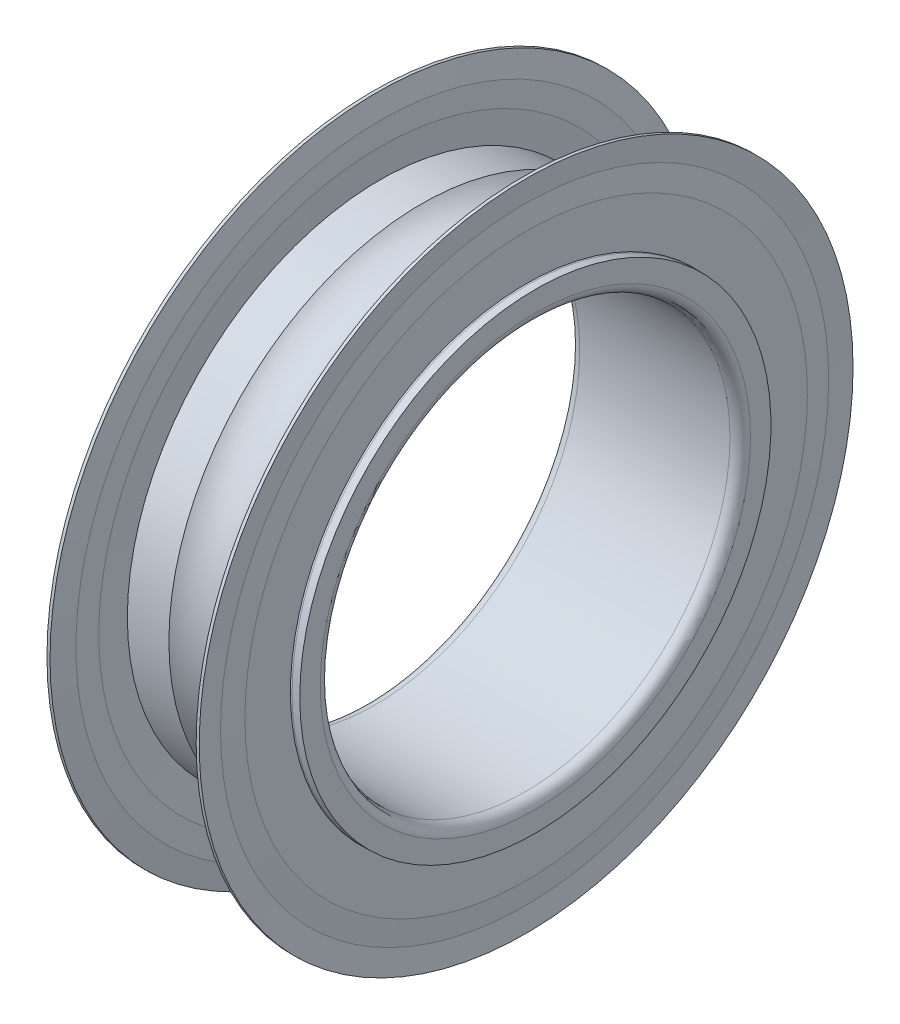
ISO-10303-21;
HEADER;
FILE_DESCRIPTION(('STEP AP214'),'2;1');
FILE_NAME('part.step','',(''),(''),'','','');
FILE_SCHEMA(('AUTOMOTIVE_DESIGN { 1 0 10303 214 1 1 1 1 }'));
ENDSEC;
DATA;
#1=APPLICATION_CONTEXT('core data for automotive mechanical design processes');
#2=APPLICATION_PROTOCOL_DEFINITION('international standard','automotive_design',2000,#1);
#3=PRODUCT_CONTEXT('',#1,'mechanical');
#4=PRODUCT('Part','Part','',(#3));
#5=PRODUCT_RELATED_PRODUCT_CATEGORY('part','',(#4));
#6=PRODUCT_DEFINITION_FORMATION('','',#4);
#7=PRODUCT_DEFINITION_CONTEXT('part definition',#1,'design');
#8=PRODUCT_DEFINITION('design','',#6,#7);
#9=PRODUCT_DEFINITION_SHAPE('','',#8);
#10=(LENGTH_UNIT() NAMED_UNIT(*) SI_UNIT(.MILLI.,.METRE.));
#11=(NAMED_UNIT(*) PLANE_ANGLE_UNIT() SI_UNIT($,.RADIAN.));
#12=(NAMED_UNIT(*) SI_UNIT($,.STERADIAN.) SOLID_ANGLE_UNIT());
#13=UNCERTAINTY_MEASURE_WITH_UNIT(LENGTH_MEASURE(1.E-05),#10,'distance_accuracy_value','');
#14=(GEOMETRIC_REPRESENTATION_CONTEXT(3) GLOBAL_UNCERTAINTY_ASSIGNED_CONTEXT((#13)) GLOBAL_UNIT_ASSIGNED_CONTEXT((#10,
#11,#12)) REPRESENTATION_CONTEXT('',''));
#15=CARTESIAN_POINT('',(0.,0.,0.));
#16=DIRECTION('',(0.,0.,1.));
#17=DIRECTION('',(1.,0.,0.));
#18=AXIS2_PLACEMENT_3D('',#15,#16,#17);
#19=CARTESIAN_POINT('',(2.5,0.,0.));
#20=DIRECTION('',(1.,0.,0.));
#21=DIRECTION('',(0.,0.,-1.));
#22=AXIS2_PLACEMENT_3D('',#19,#20,#21);
#23=TOROIDAL_SURFACE('',#22,8.25,1.1905);
#24=CARTESIAN_POINT('',(1.66645920915651,0.,0.));
#25=DIRECTION('',(-1.,0.,0.));
#26=DIRECTION('',(0.,0.,1.));
#27=AXIS2_PLACEMENT_3D('',#24,#25,#26);
#28=CIRCLE('',#27,7.4);
#29=CARTESIAN_POINT('',(1.66645920915651,0.,7.4));
#30=VERTEX_POINT('',#29);
#31=EDGE_CURVE('E257',#30,#30,#28,.T.);
#32=ORIENTED_EDGE('',*,*,#31,.F.);
#33=EDGE_LOOP('',(#32));
#34=FACE_BOUND('',#33,.T.);
#35=CARTESIAN_POINT('',(3.3335407908435,0.,0.));
#36=DIRECTION('',(-1.,0.,0.));
#37=DIRECTION('',(0.,0.,1.));
#38=AXIS2_PLACEMENT_3D('',#35,#36,#37);
#39=CIRCLE('',#38,7.4);
#40=CARTESIAN_POINT('',(3.3335407908435,0.,7.4));
#41=VERTEX_POINT('',#40);
#42=EDGE_CURVE('E260',#41,#41,#39,.F.);
#43=ORIENTED_EDGE('',*,*,#42,.F.);
#44=EDGE_LOOP('',(#43));
#45=FACE_BOUND('',#44,.T.);
#46=ADVANCED_FACE('F14',(#34,#45),#23,.F.);
#47=CARTESIAN_POINT('',(50.,0.,0.));
#48=DIRECTION('',(-1.,0.,0.));
#49=DIRECTION('',(0.,0.,1.));
#50=AXIS2_PLACEMENT_3D('',#47,#48,#49);
#51=CYLINDRICAL_SURFACE('',#50,7.4);
#52=CARTESIAN_POINT('',(4.55,0.,0.));
#53=DIRECTION('',(-1.,0.,0.));
#54=DIRECTION('',(0.,0.,1.));
#55=AXIS2_PLACEMENT_3D('',#52,#53,#54);
#56=CIRCLE('',#55,7.4);
#57=CARTESIAN_POINT('',(4.55,0.,7.4));
#58=VERTEX_POINT('',#57);
#59=EDGE_CURVE('E18',#58,#58,#56,.T.);
#60=ORIENTED_EDGE('',*,*,#59,.T.);
#61=EDGE_LOOP('',(#60));
#62=FACE_BOUND('',#61,.T.);
#63=ORIENTED_EDGE('',*,*,#42,.T.);
#64=EDGE_LOOP('',(#63));
#65=FACE_BOUND('',#64,.T.);
#66=ADVANCED_FACE('F200',(#62,#65),#51,.T.);
#67=CARTESIAN_POINT('',(50.,0.,0.));
#68=DIRECTION('',(-1.,0.,0.));
#69=DIRECTION('',(0.,0.,1.));
#70=AXIS2_PLACEMENT_3D('',#67,#68,#69);
#71=CYLINDRICAL_SURFACE('',#70,7.4);
#72=ORIENTED_EDGE('',*,*,#31,.T.);
#73=EDGE_LOOP('',(#72));
#74=FACE_BOUND('',#73,.T.);
#75=CARTESIAN_POINT('',(0.449999999999999,0.,0.));
#76=DIRECTION('',(-1.,0.,0.));
#77=DIRECTION('',(0.,0.,1.));
#78=AXIS2_PLACEMENT_3D('',#75,#76,#77);
#79=CIRCLE('',#78,7.4);
#80=CARTESIAN_POINT('',(0.449999999999999,0.,7.4));
#81=VERTEX_POINT('',#80);
#82=EDGE_CURVE('E253',#81,#81,#79,.F.);
#83=ORIENTED_EDGE('',*,*,#82,.T.);
#84=EDGE_LOOP('',(#83));
#85=FACE_BOUND('',#84,.T.);
#86=ADVANCED_FACE('F196',(#74,#85),#71,.T.);
#87=CARTESIAN_POINT('',(4.55,10.15,0.));
#88=DIRECTION('',(-1.,0.,0.));
#89=DIRECTION('',(0.,0.,1.));
#90=AXIS2_PLACEMENT_3D('',#87,#88,#89);
#91=PLANE('',#90);
#92=ORIENTED_EDGE('',*,*,#59,.F.);
#93=EDGE_LOOP('',(#92));
#94=FACE_BOUND('',#93,.T.);
#95=CARTESIAN_POINT('',(4.55,0.,0.));
#96=DIRECTION('',(1.,0.,0.));
#97=DIRECTION('',(0.,0.,-1.));
#98=AXIS2_PLACEMENT_3D('',#95,#96,#97);
#99=CIRCLE('',#98,7.125);
#100=CARTESIAN_POINT('',(4.55,0.,-7.125));
#101=VERTEX_POINT('',#100);
#102=EDGE_CURVE('E180',#101,#101,#99,.F.);
#103=ORIENTED_EDGE('',*,*,#102,.T.);
#104=EDGE_LOOP('',(#103));
#105=FACE_BOUND('',#104,.T.);
#106=ADVANCED_FACE('F186',(#94,#105),#91,.F.);
#107=CARTESIAN_POINT('',(0.45,7.125,0.));
#108=DIRECTION('',(1.,0.,0.));
#109=DIRECTION('',(0.,0.,-1.));
#110=AXIS2_PLACEMENT_3D('',#107,#108,#109);
#111=PLANE('',#110);
#112=CARTESIAN_POINT('',(0.45,0.,0.));
#113=DIRECTION('',(-1.,0.,0.));
#114=DIRECTION('',(0.,0.,-1.));
#115=AXIS2_PLACEMENT_3D('',#112,#113,#114);
#116=CIRCLE('',#115,7.125);
#117=CARTESIAN_POINT('',(0.45,0.,-7.125));
#118=VERTEX_POINT('',#117);
#119=EDGE_CURVE('E145',#118,#118,#116,.F.);
#120=ORIENTED_EDGE('',*,*,#119,.T.);
#121=EDGE_LOOP('',(#120));
#122=FACE_BOUND('',#121,.T.);
#123=ORIENTED_EDGE('',*,*,#82,.F.);
#124=EDGE_LOOP('',(#123));
#125=FACE_BOUND('',#124,.T.);
#126=ADVANCED_FACE('F195',(#122,#125),#111,.F.);
#127=CARTESIAN_POINT('',(4.775,0.,0.));
#128=DIRECTION('',(1.,0.,0.));
#129=DIRECTION('',(0.,0.,-1.));
#130=AXIS2_PLACEMENT_3D('',#127,#128,#129);
#131=TOROIDAL_SURFACE('',#130,7.125,0.225);
#132=ORIENTED_EDGE('',*,*,#102,.F.);
#133=EDGE_LOOP('',(#132));
#134=FACE_BOUND('',#133,.T.);
#135=CARTESIAN_POINT('',(4.63680784679382,0.,0.));
#136=DIRECTION('',(-1.,0.,0.));
#137=DIRECTION('',(0.,0.,1.));
#138=AXIS2_PLACEMENT_3D('',#135,#136,#137);
#139=CIRCLE('',#138,6.94743894348074);
#140=CARTESIAN_POINT('',(4.63680784679382,0.,6.94743894348074));
#141=VERTEX_POINT('',#140);
#142=EDGE_CURVE('E140',#141,#141,#139,.T.);
#143=ORIENTED_EDGE('',*,*,#142,.T.);
#144=EDGE_LOOP('',(#143));
#145=FACE_BOUND('',#144,.T.);
#146=ADVANCED_FACE('F159',(#134,#145),#131,.F.);
#147=CARTESIAN_POINT('',(0.225,0.,0.));
#148=DIRECTION('',(1.,0.,0.));
#149=DIRECTION('',(0.,0.,-1.));
#150=AXIS2_PLACEMENT_3D('',#147,#148,#149);
#151=TOROIDAL_SURFACE('',#150,7.125,0.225);
#152=CARTESIAN_POINT('',(0.363192153209013,0.,0.));
#153=DIRECTION('',(1.,0.,0.));
#154=DIRECTION('',(0.,0.,-1.));
#155=AXIS2_PLACEMENT_3D('',#152,#153,#154);
#156=CIRCLE('',#155,6.94743894348449);
#157=CARTESIAN_POINT('',(0.363192153209013,0.,-6.94743894348449));
#158=VERTEX_POINT('',#157);
#159=EDGE_CURVE('E136',#158,#158,#156,.T.);
#160=ORIENTED_EDGE('',*,*,#159,.T.);
#161=EDGE_LOOP('',(#160));
#162=FACE_BOUND('',#161,.T.);
#163=ORIENTED_EDGE('',*,*,#119,.F.);
#164=EDGE_LOOP('',(#163));
#165=FACE_BOUND('',#164,.T.);
#166=ADVANCED_FACE('F153',(#162,#165),#151,.F.);
#167=CARTESIAN_POINT('',(4.55,0.,0.));
#168=DIRECTION('',(-1.,0.,0.));
#169=DIRECTION('',(0.,0.,1.));
#170=AXIS2_PLACEMENT_3D('',#167,#168,#169);
#171=CONICAL_SURFACE('',#170,8.2375,1.50360789266071);
#172=CARTESIAN_POINT('',(4.55,0.,0.));
#173=DIRECTION('',(-1.,0.,0.));
#174=DIRECTION('',(0.,0.,1.));
#175=AXIS2_PLACEMENT_3D('',#172,#173,#174);
#176=CIRCLE('',#175,8.2375);
#177=CARTESIAN_POINT('',(4.55,0.,8.2375));
#178=VERTEX_POINT('',#177);
#179=EDGE_CURVE('E139',#178,#178,#176,.F.);
#180=ORIENTED_EDGE('',*,*,#179,.F.);
#181=EDGE_LOOP('',(#180));
#182=FACE_BOUND('',#181,.T.);
#183=ORIENTED_EDGE('',*,*,#142,.F.);
#184=EDGE_LOOP('',(#183));
#185=FACE_BOUND('',#184,.T.);
#186=ADVANCED_FACE('F158',(#182,#185),#171,.F.);
#187=CARTESIAN_POINT('',(0.450000000007833,0.,0.));
#188=DIRECTION('',(1.,0.,0.));
#189=DIRECTION('',(0.,1.,0.));
#190=AXIS2_PLACEMENT_3D('',#187,#188,#189);
#191=CONICAL_SURFACE('',#190,8.237500000007,1.50360789265702);
#192=ORIENTED_EDGE('',*,*,#159,.F.);
#193=EDGE_LOOP('',(#192));
#194=FACE_BOUND('',#193,.T.);
#195=CARTESIAN_POINT('',(0.450000000007833,0.,0.));
#196=DIRECTION('',(1.,0.,0.));
#197=DIRECTION('',(0.,1.,0.));
#198=AXIS2_PLACEMENT_3D('',#195,#196,#197);
#199=CIRCLE('',#198,8.237500000007);
#200=CARTESIAN_POINT('',(0.450000000007833,8.237500000007,0.));
#201=VERTEX_POINT('',#200);
#202=EDGE_CURVE('E249',#201,#201,#199,.F.);
#203=ORIENTED_EDGE('',*,*,#202,.F.);
#204=EDGE_LOOP('',(#203));
#205=FACE_BOUND('',#204,.T.);
#206=ADVANCED_FACE('F299',(#194,#205),#191,.F.);
#207=CARTESIAN_POINT('',(4.55,8.90625,0.));
#208=DIRECTION('',(-1.,0.,0.));
#209=DIRECTION('',(0.,0.,1.));
#210=AXIS2_PLACEMENT_3D('',#207,#208,#209);
#211=PLANE('',#210);
#212=CARTESIAN_POINT('',(4.55,0.,0.));
#213=DIRECTION('',(1.,0.,0.));
#214=DIRECTION('',(0.,0.,-1.));
#215=AXIS2_PLACEMENT_3D('',#212,#213,#214);
#216=CIRCLE('',#215,8.90625);
#217=CARTESIAN_POINT('',(4.55,0.,-8.90625));
#218=VERTEX_POINT('',#217);
#219=EDGE_CURVE('E246',#218,#218,#216,.T.);
#220=ORIENTED_EDGE('',*,*,#219,.F.);
#221=EDGE_LOOP('',(#220));
#222=FACE_BOUND('',#221,.T.);
#223=ORIENTED_EDGE('',*,*,#179,.T.);
#224=EDGE_LOOP('',(#223));
#225=FACE_BOUND('',#224,.T.);
#226=ADVANCED_FACE('F304',(#222,#225),#211,.T.);
#227=CARTESIAN_POINT('',(0.45,8.2375,0.));
#228=DIRECTION('',(1.,0.,0.));
#229=DIRECTION('',(0.,0.,-1.));
#230=AXIS2_PLACEMENT_3D('',#227,#228,#229);
#231=PLANE('',#230);
#232=ORIENTED_EDGE('',*,*,#202,.T.);
#233=EDGE_LOOP('',(#232));
#234=FACE_BOUND('',#233,.T.);
#235=CARTESIAN_POINT('',(0.449999999999999,0.,0.));
#236=DIRECTION('',(-1.,0.,0.));
#237=DIRECTION('',(0.,-1.,0.));
#238=AXIS2_PLACEMENT_3D('',#235,#236,#237);
#239=CIRCLE('',#238,8.90625);
#240=CARTESIAN_POINT('',(0.449999999999999,-8.90625,0.));
#241=VERTEX_POINT('',#240);
#242=EDGE_CURVE('E133',#241,#241,#239,.T.);
#243=ORIENTED_EDGE('',*,*,#242,.F.);
#244=EDGE_LOOP('',(#243));
#245=FACE_BOUND('',#244,.T.);
#246=ADVANCED_FACE('F309',(#234,#245),#231,.T.);
#247=CARTESIAN_POINT('',(4.64,0.,0.));
#248=DIRECTION('',(1.,0.,0.));
#249=DIRECTION('',(0.,0.,-1.));
#250=AXIS2_PLACEMENT_3D('',#247,#248,#249);
#251=CONICAL_SURFACE('',#250,9.575,1.43702065506807);
#252=CARTESIAN_POINT('',(4.64,0.,0.));
#253=DIRECTION('',(-1.,0.,0.));
#254=DIRECTION('',(0.,0.,1.));
#255=AXIS2_PLACEMENT_3D('',#252,#253,#254);
#256=CIRCLE('',#255,9.575);
#257=CARTESIAN_POINT('',(4.64,0.,9.575));
#258=VERTEX_POINT('',#257);
#259=EDGE_CURVE('E128',#258,#258,#256,.F.);
#260=ORIENTED_EDGE('',*,*,#259,.F.);
#261=EDGE_LOOP('',(#260));
#262=FACE_BOUND('',#261,.T.);
#263=ORIENTED_EDGE('',*,*,#219,.T.);
#264=EDGE_LOOP('',(#263));
#265=FACE_BOUND('',#264,.T.);
#266=ADVANCED_FACE('F315',(#262,#265),#251,.T.);
#267=CARTESIAN_POINT('',(0.360000000000001,0.,0.));
#268=DIRECTION('',(-1.,0.,0.));
#269=DIRECTION('',(0.,-1.,0.));
#270=AXIS2_PLACEMENT_3D('',#267,#268,#269);
#271=CONICAL_SURFACE('',#270,9.575,1.43702065506807);
#272=ORIENTED_EDGE('',*,*,#242,.T.);
#273=EDGE_LOOP('',(#272));
#274=FACE_BOUND('',#273,.T.);
#275=CARTESIAN_POINT('',(0.359999999999999,0.,0.));
#276=DIRECTION('',(-1.,0.,0.));
#277=DIRECTION('',(0.,0.,1.));
#278=AXIS2_PLACEMENT_3D('',#275,#276,#277);
#279=CIRCLE('',#278,9.575);
#280=CARTESIAN_POINT('',(0.359999999999999,0.,9.575));
#281=VERTEX_POINT('',#280);
#282=EDGE_CURVE('E123',#281,#281,#279,.T.);
#283=ORIENTED_EDGE('',*,*,#282,.F.);
#284=EDGE_LOOP('',(#283));
#285=FACE_BOUND('',#284,.T.);
#286=ADVANCED_FACE('F322',(#274,#285),#271,.T.);
#287=CARTESIAN_POINT('',(50.,0.,0.));
#288=DIRECTION('',(-1.,0.,0.));
#289=DIRECTION('',(0.,0.,1.));
#290=AXIS2_PLACEMENT_3D('',#287,#288,#289);
#291=CYLINDRICAL_SURFACE('',#290,9.575);
#292=CARTESIAN_POINT('',(4.73,0.,0.));
#293=DIRECTION('',(1.,0.,0.));
#294=DIRECTION('',(0.,0.,-1.));
#295=AXIS2_PLACEMENT_3D('',#292,#293,#294);
#296=CIRCLE('',#295,9.575);
#297=CARTESIAN_POINT('',(4.73,0.,-9.575));
#298=VERTEX_POINT('',#297);
#299=EDGE_CURVE('E118',#298,#298,#296,.F.);
#300=ORIENTED_EDGE('',*,*,#299,.T.);
#301=EDGE_LOOP('',(#300));
#302=FACE_BOUND('',#301,.T.);
#303=ORIENTED_EDGE('',*,*,#259,.T.);
#304=EDGE_LOOP('',(#303));
#305=FACE_BOUND('',#304,.T.);
#306=ADVANCED_FACE('F326',(#302,#305),#291,.T.);
#307=CARTESIAN_POINT('',(50.,0.,0.));
#308=DIRECTION('',(-1.,0.,0.));
#309=DIRECTION('',(0.,0.,1.));
#310=AXIS2_PLACEMENT_3D('',#307,#308,#309);
#311=CYLINDRICAL_SURFACE('',#310,9.575);
#312=ORIENTED_EDGE('',*,*,#282,.T.);
#313=EDGE_LOOP('',(#312));
#314=FACE_BOUND('',#313,.T.);
#315=CARTESIAN_POINT('',(0.269999999999999,0.,0.));
#316=DIRECTION('',(-1.,0.,0.));
#317=DIRECTION('',(0.,0.,1.));
#318=AXIS2_PLACEMENT_3D('',#315,#316,#317);
#319=CIRCLE('',#318,9.575);
#320=CARTESIAN_POINT('',(0.269999999999999,0.,9.575));
#321=VERTEX_POINT('',#320);
#322=EDGE_CURVE('E113',#321,#321,#319,.F.);
#323=ORIENTED_EDGE('',*,*,#322,.T.);
#324=EDGE_LOOP('',(#323));
#325=FACE_BOUND('',#324,.T.);
#326=ADVANCED_FACE('F330',(#314,#325),#311,.T.);
#327=CARTESIAN_POINT('',(4.73,0.,0.));
#328=DIRECTION('',(1.,0.,0.));
#329=DIRECTION('',(0.,0.,-1.));
#330=AXIS2_PLACEMENT_3D('',#327,#328,#329);
#331=CONICAL_SURFACE('',#330,9.575,1.50360789266071);
#332=CARTESIAN_POINT('',(4.685,0.,0.));
#333=DIRECTION('',(-1.,0.,0.));
#334=DIRECTION('',(0.,0.,1.));
#335=AXIS2_PLACEMENT_3D('',#332,#333,#334);
#336=CIRCLE('',#335,8.90625);
#337=CARTESIAN_POINT('',(4.685,0.,8.90625));
#338=VERTEX_POINT('',#337);
#339=EDGE_CURVE('E108',#338,#338,#336,.F.);
#340=ORIENTED_EDGE('',*,*,#339,.F.);
#341=EDGE_LOOP('',(#340));
#342=FACE_BOUND('',#341,.T.);
#343=ORIENTED_EDGE('',*,*,#299,.F.);
#344=EDGE_LOOP('',(#343));
#345=FACE_BOUND('',#344,.T.);
#346=ADVANCED_FACE('F334',(#342,#345),#331,.F.);
#347=CARTESIAN_POINT('',(0.269999999999999,0.,0.));
#348=DIRECTION('',(-1.,0.,0.));
#349=DIRECTION('',(0.,-1.,0.));
#350=AXIS2_PLACEMENT_3D('',#347,#348,#349);
#351=CONICAL_SURFACE('',#350,9.575,1.5036078926607);
#352=ORIENTED_EDGE('',*,*,#322,.F.);
#353=EDGE_LOOP('',(#352));
#354=FACE_BOUND('',#353,.T.);
#355=CARTESIAN_POINT('',(0.315000000000003,0.,0.));
#356=DIRECTION('',(1.,0.,0.));
#357=DIRECTION('',(0.,0.,-1.));
#358=AXIS2_PLACEMENT_3D('',#355,#356,#357);
#359=CIRCLE('',#358,8.90625);
#360=CARTESIAN_POINT('',(0.315000000000003,0.,-8.90625));
#361=VERTEX_POINT('',#360);
#362=EDGE_CURVE('E104',#361,#361,#359,.F.);
#363=ORIENTED_EDGE('',*,*,#362,.F.);
#364=EDGE_LOOP('',(#363));
#365=FACE_BOUND('',#364,.T.);
#366=ADVANCED_FACE('F338',(#354,#365),#351,.F.);
#367=CARTESIAN_POINT('',(4.685,0.,0.));
#368=DIRECTION('',(-1.,0.,0.));
#369=DIRECTION('',(0.,0.,1.));
#370=AXIS2_PLACEMENT_3D('',#367,#368,#369);
#371=CONICAL_SURFACE('',#370,8.90625,1.50360789266071);
#372=CARTESIAN_POINT('',(4.73,0.,0.));
#373=DIRECTION('',(-1.,0.,0.));
#374=DIRECTION('',(0.,0.,1.));
#375=AXIS2_PLACEMENT_3D('',#372,#373,#374);
#376=CIRCLE('',#375,8.2375);
#377=CARTESIAN_POINT('',(4.73,0.,8.2375));
#378=VERTEX_POINT('',#377);
#379=EDGE_CURVE('E107',#378,#378,#376,.F.);
#380=ORIENTED_EDGE('',*,*,#379,.F.);
#381=EDGE_LOOP('',(#380));
#382=FACE_BOUND('',#381,.T.);
#383=ORIENTED_EDGE('',*,*,#339,.T.);
#384=EDGE_LOOP('',(#383));
#385=FACE_BOUND('',#384,.T.);
#386=ADVANCED_FACE('F342',(#382,#385),#371,.T.);
#387=CARTESIAN_POINT('',(0.315000000000003,0.,0.));
#388=DIRECTION('',(1.,0.,0.));
#389=DIRECTION('',(0.,0.,-1.));
#390=AXIS2_PLACEMENT_3D('',#387,#388,#389);
#391=CONICAL_SURFACE('',#390,8.90625,1.5036078926607);
#392=ORIENTED_EDGE('',*,*,#362,.T.);
#393=EDGE_LOOP('',(#392));
#394=FACE_BOUND('',#393,.T.);
#395=CARTESIAN_POINT('',(0.269999999999997,0.,0.));
#396=DIRECTION('',(1.,0.,0.));
#397=DIRECTION('',(0.,0.,-1.));
#398=AXIS2_PLACEMENT_3D('',#395,#396,#397);
#399=CIRCLE('',#398,8.2375);
#400=CARTESIAN_POINT('',(0.269999999999997,0.,-8.2375));
#401=VERTEX_POINT('',#400);
#402=EDGE_CURVE('E239',#401,#401,#399,.F.);
#403=ORIENTED_EDGE('',*,*,#402,.F.);
#404=EDGE_LOOP('',(#403));
#405=FACE_BOUND('',#404,.T.);
#406=ADVANCED_FACE('F346',(#394,#405),#391,.T.);
#407=CARTESIAN_POINT('',(4.73,6.9,0.));
#408=DIRECTION('',(1.,0.,0.));
#409=DIRECTION('',(0.,0.,-1.));
#410=AXIS2_PLACEMENT_3D('',#407,#408,#409);
#411=PLANE('',#410);
#412=CARTESIAN_POINT('',(4.73,0.,0.));
#413=DIRECTION('',(1.,0.,0.));
#414=DIRECTION('',(0.,0.,-1.));
#415=AXIS2_PLACEMENT_3D('',#412,#413,#414);
#416=CIRCLE('',#415,6.90454592314951);
#417=CARTESIAN_POINT('',(4.73,0.,-6.90454592314951));
#418=VERTEX_POINT('',#417);
#419=EDGE_CURVE('E236',#418,#418,#416,.F.);
#420=ORIENTED_EDGE('',*,*,#419,.T.);
#421=EDGE_LOOP('',(#420));
#422=FACE_BOUND('',#421,.T.);
#423=ORIENTED_EDGE('',*,*,#379,.T.);
#424=EDGE_LOOP('',(#423));
#425=FACE_BOUND('',#424,.T.);
#426=ADVANCED_FACE('F350',(#422,#425),#411,.T.);
#427=CARTESIAN_POINT('',(0.27,8.2375,0.));
#428=DIRECTION('',(-1.,0.,0.));
#429=DIRECTION('',(0.,0.,1.));
#430=AXIS2_PLACEMENT_3D('',#427,#428,#429);
#431=PLANE('',#430);
#432=ORIENTED_EDGE('',*,*,#402,.T.);
#433=EDGE_LOOP('',(#432));
#434=FACE_BOUND('',#433,.T.);
#435=CARTESIAN_POINT('',(0.27,0.,0.));
#436=DIRECTION('',(1.,0.,0.));
#437=DIRECTION('',(0.,0.,-1.));
#438=AXIS2_PLACEMENT_3D('',#435,#436,#437);
#439=CIRCLE('',#438,6.90454592314951);
#440=CARTESIAN_POINT('',(0.27,0.,-6.90454592314951));
#441=VERTEX_POINT('',#440);
#442=EDGE_CURVE('E232',#441,#441,#439,.T.);
#443=ORIENTED_EDGE('',*,*,#442,.T.);
#444=EDGE_LOOP('',(#443));
#445=FACE_BOUND('',#444,.T.);
#446=ADVANCED_FACE('F353',(#434,#445),#431,.T.);
#447=CARTESIAN_POINT('',(4.775,0.,0.));
#448=DIRECTION('',(1.,0.,0.));
#449=DIRECTION('',(0.,0.,-1.));
#450=AXIS2_PLACEMENT_3D('',#447,#448,#449);
#451=TOROIDAL_SURFACE('',#450,7.125,0.225);
#452=ORIENTED_EDGE('',*,*,#419,.F.);
#453=EDGE_LOOP('',(#452));
#454=FACE_BOUND('',#453,.T.);
#455=CARTESIAN_POINT('',(4.775,0.,0.));
#456=DIRECTION('',(-1.,0.,0.));
#457=DIRECTION('',(0.,0.,1.));
#458=AXIS2_PLACEMENT_3D('',#455,#456,#457);
#459=CIRCLE('',#458,6.9);
#460=CARTESIAN_POINT('',(4.775,0.,6.9));
#461=VERTEX_POINT('',#460);
#462=EDGE_CURVE('E235',#461,#461,#459,.F.);
#463=ORIENTED_EDGE('',*,*,#462,.F.);
#464=EDGE_LOOP('',(#463));
#465=FACE_BOUND('',#464,.T.);
#466=ADVANCED_FACE('F94',(#454,#465),#451,.F.);
#467=CARTESIAN_POINT('',(0.225,0.,0.));
#468=DIRECTION('',(1.,0.,0.));
#469=DIRECTION('',(0.,0.,-1.));
#470=AXIS2_PLACEMENT_3D('',#467,#468,#469);
#471=TOROIDAL_SURFACE('',#470,7.125,0.225);
#472=CARTESIAN_POINT('',(0.225000000000003,0.,0.));
#473=DIRECTION('',(-1.,0.,0.));
#474=DIRECTION('',(0.,0.,1.));
#475=AXIS2_PLACEMENT_3D('',#472,#473,#474);
#476=CIRCLE('',#475,6.9);
#477=CARTESIAN_POINT('',(0.225000000000003,0.,6.9));
#478=VERTEX_POINT('',#477);
#479=EDGE_CURVE('E227',#478,#478,#476,.T.);
#480=ORIENTED_EDGE('',*,*,#479,.F.);
#481=EDGE_LOOP('',(#480));
#482=FACE_BOUND('',#481,.T.);
#483=ORIENTED_EDGE('',*,*,#442,.F.);
#484=EDGE_LOOP('',(#483));
#485=FACE_BOUND('',#484,.T.);
#486=ADVANCED_FACE('F89',(#482,#485),#471,.F.);
#487=CARTESIAN_POINT('',(50.,0.,0.));
#488=DIRECTION('',(-1.,0.,0.));
#489=DIRECTION('',(0.,0.,1.));
#490=AXIS2_PLACEMENT_3D('',#487,#488,#489);
#491=CYLINDRICAL_SURFACE('',#490,6.9);
#492=ORIENTED_EDGE('',*,*,#462,.T.);
#493=EDGE_LOOP('',(#492));
#494=FACE_BOUND('',#493,.T.);
#495=CARTESIAN_POINT('',(5.,0.,0.));
#496=DIRECTION('',(-1.,0.,0.));
#497=DIRECTION('',(0.,0.,1.));
#498=AXIS2_PLACEMENT_3D('',#495,#496,#497);
#499=CIRCLE('',#498,6.9);
#500=CARTESIAN_POINT('',(5.,0.,6.9));
#501=VERTEX_POINT('',#500);
#502=EDGE_CURVE('E222',#501,#501,#499,.F.);
#503=ORIENTED_EDGE('',*,*,#502,.F.);
#504=EDGE_LOOP('',(#503));
#505=FACE_BOUND('',#504,.T.);
#506=ADVANCED_FACE('F85',(#494,#505),#491,.T.);
#507=CARTESIAN_POINT('',(50.,0.,0.));
#508=DIRECTION('',(-1.,0.,0.));
#509=DIRECTION('',(0.,0.,1.));
#510=AXIS2_PLACEMENT_3D('',#507,#508,#509);
#511=CYLINDRICAL_SURFACE('',#510,6.9);
#512=CARTESIAN_POINT('',(0.,0.,0.));
#513=DIRECTION('',(-1.,0.,0.));
#514=DIRECTION('',(0.,0.,1.));
#515=AXIS2_PLACEMENT_3D('',#512,#513,#514);
#516=CIRCLE('',#515,6.9);
#517=CARTESIAN_POINT('',(0.,0.,6.9));
#518=VERTEX_POINT('',#517);
#519=EDGE_CURVE('E220',#518,#518,#516,.T.);
#520=ORIENTED_EDGE('',*,*,#519,.F.);
#521=EDGE_LOOP('',(#520));
#522=FACE_BOUND('',#521,.T.);
#523=ORIENTED_EDGE('',*,*,#479,.T.);
#524=EDGE_LOOP('',(#523));
#525=FACE_BOUND('',#524,.T.);
#526=ADVANCED_FACE('F81',(#522,#525),#511,.T.);
#527=CARTESIAN_POINT('',(5.,6.3,0.));
#528=DIRECTION('',(1.,0.,0.));
#529=DIRECTION('',(0.,0.,-1.));
#530=AXIS2_PLACEMENT_3D('',#527,#528,#529);
#531=PLANE('',#530);
#532=CARTESIAN_POINT('',(5.,0.,0.));
#533=DIRECTION('',(1.,0.,0.));
#534=DIRECTION('',(0.,0.,-1.));
#535=AXIS2_PLACEMENT_3D('',#532,#533,#534);
#536=CIRCLE('',#535,6.3);
#537=CARTESIAN_POINT('',(5.,0.,-6.3));
#538=VERTEX_POINT('',#537);
#539=EDGE_CURVE('E65',#538,#538,#536,.T.);
#540=ORIENTED_EDGE('',*,*,#539,.F.);
#541=EDGE_LOOP('',(#540));
#542=FACE_BOUND('',#541,.T.);
#543=ORIENTED_EDGE('',*,*,#502,.T.);
#544=EDGE_LOOP('',(#543));
#545=FACE_BOUND('',#544,.T.);
#546=ADVANCED_FACE('F71',(#542,#545),#531,.T.);
#547=CARTESIAN_POINT('',(0.,7.3,0.));
#548=DIRECTION('',(-1.,0.,0.));
#549=DIRECTION('',(0.,0.,1.));
#550=AXIS2_PLACEMENT_3D('',#547,#548,#549);
#551=PLANE('',#550);
#552=ORIENTED_EDGE('',*,*,#519,.T.);
#553=EDGE_LOOP('',(#552));
#554=FACE_BOUND('',#553,.T.);
#555=CARTESIAN_POINT('',(0.,0.,0.));
#556=DIRECTION('',(-1.,0.,0.));
#557=DIRECTION('',(0.,0.,-1.));
#558=AXIS2_PLACEMENT_3D('',#555,#556,#557);
#559=CIRCLE('',#558,6.3);
#560=CARTESIAN_POINT('',(0.,0.,-6.3));
#561=VERTEX_POINT('',#560);
#562=EDGE_CURVE('E27',#561,#561,#559,.T.);
#563=ORIENTED_EDGE('',*,*,#562,.F.);
#564=EDGE_LOOP('',(#563));
#565=FACE_BOUND('',#564,.T.);
#566=ADVANCED_FACE('F80',(#554,#565),#551,.T.);
#567=CARTESIAN_POINT('',(4.7,0.,0.));
#568=DIRECTION('',(1.,0.,0.));
#569=DIRECTION('',(0.,0.,-1.));
#570=AXIS2_PLACEMENT_3D('',#567,#568,#569);
#571=TOROIDAL_SURFACE('',#570,6.3,0.300000000000003);
#572=CARTESIAN_POINT('',(4.7,0.,0.));
#573=DIRECTION('',(-1.,0.,0.));
#574=DIRECTION('',(0.,0.,1.));
#575=AXIS2_PLACEMENT_3D('',#572,#573,#574);
#576=CIRCLE('',#575,6.);
#577=CARTESIAN_POINT('',(4.7,0.,6.));
#578=VERTEX_POINT('',#577);
#579=EDGE_CURVE('E22',#578,#578,#576,.T.);
#580=ORIENTED_EDGE('',*,*,#579,.T.);
#581=EDGE_LOOP('',(#580));
#582=FACE_BOUND('',#581,.T.);
#583=ORIENTED_EDGE('',*,*,#539,.T.);
#584=EDGE_LOOP('',(#583));
#585=FACE_BOUND('',#584,.T.);
#586=ADVANCED_FACE('F45',(#582,#585),#571,.T.);
#587=CARTESIAN_POINT('',(0.300000000000002,0.,0.));
#588=DIRECTION('',(1.,0.,0.));
#589=DIRECTION('',(0.,0.,-1.));
#590=AXIS2_PLACEMENT_3D('',#587,#588,#589);
#591=TOROIDAL_SURFACE('',#590,6.3,0.300000000000002);
#592=ORIENTED_EDGE('',*,*,#562,.T.);
#593=EDGE_LOOP('',(#592));
#594=FACE_BOUND('',#593,.T.);
#595=CARTESIAN_POINT('',(0.300000000000002,0.,0.));
#596=DIRECTION('',(-1.,0.,0.));
#597=DIRECTION('',(0.,0.,1.));
#598=AXIS2_PLACEMENT_3D('',#595,#596,#597);
#599=CIRCLE('',#598,6.);
#600=CARTESIAN_POINT('',(0.300000000000002,0.,6.));
#601=VERTEX_POINT('',#600);
#602=EDGE_CURVE('E10',#601,#601,#599,.F.);
#603=ORIENTED_EDGE('',*,*,#602,.T.);
#604=EDGE_LOOP('',(#603));
#605=FACE_BOUND('',#604,.T.);
#606=ADVANCED_FACE('F39',(#594,#605),#591,.T.);
#607=CARTESIAN_POINT('',(50.,0.,0.));
#608=DIRECTION('',(-1.,0.,0.));
#609=DIRECTION('',(0.,0.,1.));
#610=AXIS2_PLACEMENT_3D('',#607,#608,#609);
#611=CYLINDRICAL_SURFACE('',#610,6.);
#612=ORIENTED_EDGE('',*,*,#602,.F.);
#613=EDGE_LOOP('',(#612));
#614=FACE_BOUND('',#613,.T.);
#615=ORIENTED_EDGE('',*,*,#579,.F.);
#616=EDGE_LOOP('',(#615));
#617=FACE_BOUND('',#616,.T.);
#618=ADVANCED_FACE('F44',(#614,#617),#611,.F.);
#619=CLOSED_SHELL('',(#46,#66,#86,#106,#126,#146,#166,#186,#206,#226,#246,#266,#286,#306,#326,
#346,#366,#386,#406,#426,#446,#466,#486,#506,#526,#546,#566,#586,#606,#618));
#620=MANIFOLD_SOLID_BREP('B1',#619);
#621=ADVANCED_BREP_SHAPE_REPRESENTATION('',(#18,#620),#14);
#622=SHAPE_DEFINITION_REPRESENTATION(#9,#621);
ENDSEC;
END-ISO-10303-21;
